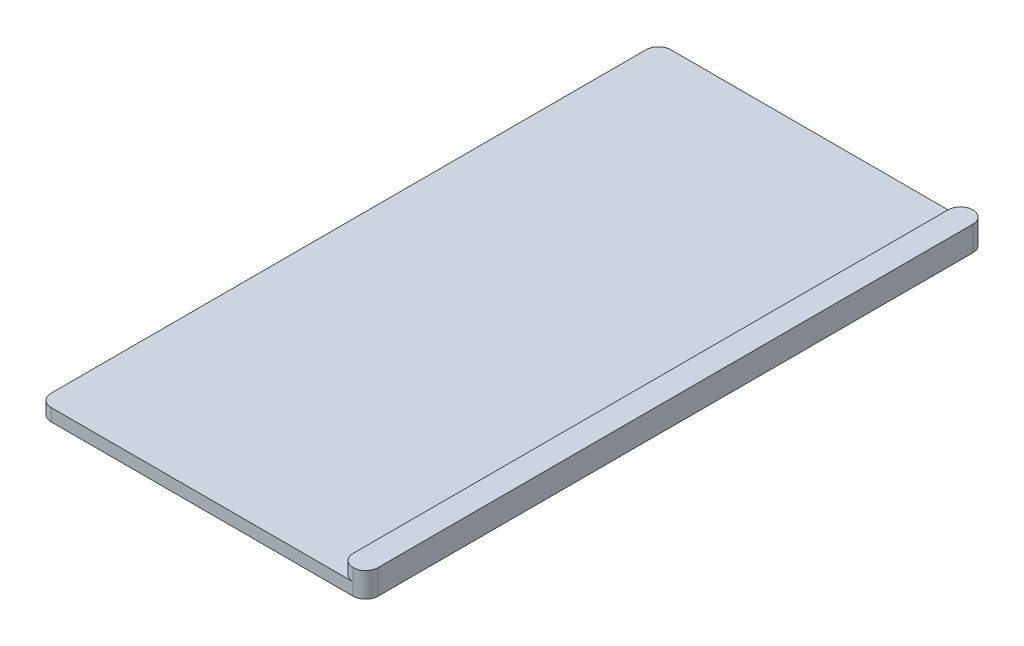
ISO-10303-21;
HEADER;
FILE_DESCRIPTION(('STEP AP214'),'2;1');
FILE_NAME('part.step','',(''),(''),'','','');
FILE_SCHEMA(('AUTOMOTIVE_DESIGN { 1 0 10303 214 1 1 1 1 }'));
ENDSEC;
DATA;
#1=APPLICATION_CONTEXT('core data for automotive mechanical design processes');
#2=APPLICATION_PROTOCOL_DEFINITION('international standard','automotive_design',2000,#1);
#3=PRODUCT_CONTEXT('',#1,'mechanical');
#4=PRODUCT('Part','Part','',(#3));
#5=PRODUCT_RELATED_PRODUCT_CATEGORY('part','',(#4));
#6=PRODUCT_DEFINITION_FORMATION('','',#4);
#7=PRODUCT_DEFINITION_CONTEXT('part definition',#1,'design');
#8=PRODUCT_DEFINITION('design','',#6,#7);
#9=PRODUCT_DEFINITION_SHAPE('','',#8);
#10=(LENGTH_UNIT() NAMED_UNIT(*) SI_UNIT(.MILLI.,.METRE.));
#11=(NAMED_UNIT(*) PLANE_ANGLE_UNIT() SI_UNIT($,.RADIAN.));
#12=(NAMED_UNIT(*) SI_UNIT($,.STERADIAN.) SOLID_ANGLE_UNIT());
#13=UNCERTAINTY_MEASURE_WITH_UNIT(LENGTH_MEASURE(1.E-05),#10,'distance_accuracy_value','');
#14=(GEOMETRIC_REPRESENTATION_CONTEXT(3) GLOBAL_UNCERTAINTY_ASSIGNED_CONTEXT((#13)) GLOBAL_UNIT_ASSIGNED_CONTEXT((#10,
#11,#12)) REPRESENTATION_CONTEXT('',''));
#15=CARTESIAN_POINT('',(0.,0.,0.));
#16=DIRECTION('',(0.,0.,1.));
#17=DIRECTION('',(1.,0.,0.));
#18=AXIS2_PLACEMENT_3D('',#15,#16,#17);
#19=CARTESIAN_POINT('',(0.,0.8,40.));
#20=DIRECTION('',(1.,0.,0.));
#21=DIRECTION('',(0.,0.,-1.));
#22=AXIS2_PLACEMENT_3D('',#19,#20,#21);
#23=PLANE('',#22);
#24=DIRECTION('',(0.,0.,-1.));
#25=VECTOR('',#24,1.);
#26=CARTESIAN_POINT('',(0.,0.8,40.));
#27=LINE('',#26,#25);
#28=CARTESIAN_POINT('',(0.,0.8,39.2));
#29=VERTEX_POINT('',#28);
#30=CARTESIAN_POINT('',(0.,0.8,0.800000000000002));
#31=VERTEX_POINT('',#30);
#32=EDGE_CURVE('E147',#29,#31,#27,.T.);
#33=ORIENTED_EDGE('',*,*,#32,.T.);
#34=DIRECTION('',(0.,-1.,0.));
#35=VECTOR('',#34,1.);
#36=CARTESIAN_POINT('',(0.,0.8,0.800000000000002));
#37=LINE('',#36,#35);
#38=CARTESIAN_POINT('',(0.,0.,0.800000000000002));
#39=VERTEX_POINT('',#38);
#40=EDGE_CURVE('E182',#31,#39,#37,.T.);
#41=ORIENTED_EDGE('',*,*,#40,.T.);
#42=DIRECTION('',(0.,0.,-1.));
#43=VECTOR('',#42,1.);
#44=CARTESIAN_POINT('',(0.,0.,40.));
#45=LINE('',#44,#43);
#46=CARTESIAN_POINT('',(0.,0.,39.2));
#47=VERTEX_POINT('',#46);
#48=EDGE_CURVE('E152',#47,#39,#45,.T.);
#49=ORIENTED_EDGE('',*,*,#48,.F.);
#50=DIRECTION('',(0.,-1.,0.));
#51=VECTOR('',#50,1.);
#52=CARTESIAN_POINT('',(0.,0.8,39.2));
#53=LINE('',#52,#51);
#54=EDGE_CURVE('E179',#47,#29,#53,.F.);
#55=ORIENTED_EDGE('',*,*,#54,.T.);
#56=EDGE_LOOP('',(#33,#41,#49,#55));
#57=FACE_BOUND('',#56,.T.);
#58=ADVANCED_FACE('F45',(#57),#23,.F.);
#59=CARTESIAN_POINT('',(0.,0.,40.));
#60=DIRECTION('',(0.,1.,0.));
#61=DIRECTION('',(0.,0.,1.));
#62=AXIS2_PLACEMENT_3D('',#59,#60,#61);
#63=PLANE('',#62);
#64=ORIENTED_EDGE('',*,*,#48,.T.);
#65=CARTESIAN_POINT('',(0.8,0.,0.800000000000002));
#66=DIRECTION('',(0.,1.,0.));
#67=DIRECTION('',(0.,0.,1.));
#68=AXIS2_PLACEMENT_3D('',#65,#66,#67);
#69=CIRCLE('',#68,0.8);
#70=CARTESIAN_POINT('',(0.8,0.,0.));
#71=VERTEX_POINT('',#70);
#72=EDGE_CURVE('E195',#39,#71,#69,.F.);
#73=ORIENTED_EDGE('',*,*,#72,.T.);
#74=DIRECTION('',(1.,0.,0.));
#75=VECTOR('',#74,1.);
#76=CARTESIAN_POINT('',(0.,0.,0.));
#77=LINE('',#76,#75);
#78=CARTESIAN_POINT('',(20.3,0.,0.));
#79=VERTEX_POINT('',#78);
#80=EDGE_CURVE('E220',#71,#79,#77,.T.);
#81=ORIENTED_EDGE('',*,*,#80,.T.);
#82=CARTESIAN_POINT('',(20.3,0.,0.800000000000002));
#83=DIRECTION('',(0.,1.,0.));
#84=DIRECTION('',(0.,0.,1.));
#85=AXIS2_PLACEMENT_3D('',#82,#83,#84);
#86=CIRCLE('',#85,0.8);
#87=CARTESIAN_POINT('',(21.1,0.,0.800000000000002));
#88=VERTEX_POINT('',#87);
#89=EDGE_CURVE('E192',#79,#88,#86,.F.);
#90=ORIENTED_EDGE('',*,*,#89,.T.);
#91=DIRECTION('',(0.,0.,-1.));
#92=VECTOR('',#91,1.);
#93=CARTESIAN_POINT('',(21.1,0.,40.));
#94=LINE('',#93,#92);
#95=CARTESIAN_POINT('',(21.1,0.,39.2));
#96=VERTEX_POINT('',#95);
#97=EDGE_CURVE('E159',#96,#88,#94,.T.);
#98=ORIENTED_EDGE('',*,*,#97,.F.);
#99=CARTESIAN_POINT('',(20.3,0.,39.2));
#100=DIRECTION('',(0.,1.,0.));
#101=DIRECTION('',(0.,0.,1.));
#102=AXIS2_PLACEMENT_3D('',#99,#100,#101);
#103=CIRCLE('',#102,0.8);
#104=CARTESIAN_POINT('',(20.3,0.,40.));
#105=VERTEX_POINT('',#104);
#106=EDGE_CURVE('E189',#96,#105,#103,.F.);
#107=ORIENTED_EDGE('',*,*,#106,.T.);
#108=DIRECTION('',(1.,0.,0.));
#109=VECTOR('',#108,1.);
#110=CARTESIAN_POINT('',(0.,0.,40.));
#111=LINE('',#110,#109);
#112=CARTESIAN_POINT('',(0.8,0.,40.));
#113=VERTEX_POINT('',#112);
#114=EDGE_CURVE('E257',#113,#105,#111,.T.);
#115=ORIENTED_EDGE('',*,*,#114,.F.);
#116=CARTESIAN_POINT('',(0.8,0.,39.2));
#117=DIRECTION('',(0.,1.,0.));
#118=DIRECTION('',(0.,0.,1.));
#119=AXIS2_PLACEMENT_3D('',#116,#117,#118);
#120=CIRCLE('',#119,0.8);
#121=EDGE_CURVE('E186',#113,#47,#120,.F.);
#122=ORIENTED_EDGE('',*,*,#121,.T.);
#123=EDGE_LOOP('',(#64,#73,#81,#90,#98,#107,#115,#122));
#124=FACE_BOUND('',#123,.T.);
#125=ADVANCED_FACE('F268',(#124),#63,.F.);
#126=CARTESIAN_POINT('',(21.1,0.,40.));
#127=DIRECTION('',(-1.,0.,0.));
#128=DIRECTION('',(0.,0.,1.));
#129=AXIS2_PLACEMENT_3D('',#126,#127,#128);
#130=PLANE('',#129);
#131=ORIENTED_EDGE('',*,*,#97,.T.);
#132=DIRECTION('',(0.,1.,0.));
#133=VECTOR('',#132,1.);
#134=CARTESIAN_POINT('',(21.1,0.,0.800000000000002));
#135=LINE('',#134,#133);
#136=CARTESIAN_POINT('',(21.1,1.6,0.800000000000002));
#137=VERTEX_POINT('',#136);
#138=EDGE_CURVE('E206',#88,#137,#135,.T.);
#139=ORIENTED_EDGE('',*,*,#138,.T.);
#140=DIRECTION('',(0.,0.,-1.));
#141=VECTOR('',#140,1.);
#142=CARTESIAN_POINT('',(21.1,1.6,40.));
#143=LINE('',#142,#141);
#144=CARTESIAN_POINT('',(21.1,1.6,39.2));
#145=VERTEX_POINT('',#144);
#146=EDGE_CURVE('E240',#145,#137,#143,.T.);
#147=ORIENTED_EDGE('',*,*,#146,.F.);
#148=DIRECTION('',(0.,1.,0.));
#149=VECTOR('',#148,1.);
#150=CARTESIAN_POINT('',(21.1,0.,39.2));
#151=LINE('',#150,#149);
#152=EDGE_CURVE('E203',#145,#96,#151,.F.);
#153=ORIENTED_EDGE('',*,*,#152,.T.);
#154=EDGE_LOOP('',(#131,#139,#147,#153));
#155=FACE_BOUND('',#154,.T.);
#156=ADVANCED_FACE('F244',(#155),#130,.F.);
#157=CARTESIAN_POINT('',(21.1,1.6,40.));
#158=DIRECTION('',(0.,-1.,0.));
#159=DIRECTION('',(1.,0.,0.));
#160=AXIS2_PLACEMENT_3D('',#157,#158,#159);
#161=PLANE('',#160);
#162=CARTESIAN_POINT('',(20.3,1.6,0.800000000000002));
#163=DIRECTION('',(0.,-1.,0.));
#164=DIRECTION('',(1.,0.,0.));
#165=AXIS2_PLACEMENT_3D('',#162,#163,#164);
#166=CIRCLE('',#165,0.8);
#167=CARTESIAN_POINT('',(20.3,1.6,0.));
#168=VERTEX_POINT('',#167);
#169=EDGE_CURVE('E173',#137,#168,#166,.F.);
#170=ORIENTED_EDGE('',*,*,#169,.T.);
#171=CARTESIAN_POINT('',(20.3,1.6,0.800000000000002));
#172=DIRECTION('',(0.,-1.,0.));
#173=DIRECTION('',(1.,0.,0.));
#174=AXIS2_PLACEMENT_3D('',#171,#172,#173);
#175=CIRCLE('',#174,0.8);
#176=CARTESIAN_POINT('',(19.5,1.6,0.800000000000002));
#177=VERTEX_POINT('',#176);
#178=EDGE_CURVE('E176',#168,#177,#175,.F.);
#179=ORIENTED_EDGE('',*,*,#178,.T.);
#180=DIRECTION('',(0.,0.,-1.));
#181=VECTOR('',#180,1.);
#182=CARTESIAN_POINT('',(19.5,1.6,40.));
#183=LINE('',#182,#181);
#184=CARTESIAN_POINT('',(19.5,1.6,39.2));
#185=VERTEX_POINT('',#184);
#186=EDGE_CURVE('E146',#185,#177,#183,.T.);
#187=ORIENTED_EDGE('',*,*,#186,.F.);
#188=CARTESIAN_POINT('',(20.3,1.6,39.2));
#189=DIRECTION('',(0.,-1.,0.));
#190=DIRECTION('',(1.,0.,0.));
#191=AXIS2_PLACEMENT_3D('',#188,#189,#190);
#192=CIRCLE('',#191,0.8);
#193=CARTESIAN_POINT('',(20.3,1.6,40.));
#194=VERTEX_POINT('',#193);
#195=EDGE_CURVE('E150',#185,#194,#192,.F.);
#196=ORIENTED_EDGE('',*,*,#195,.T.);
#197=CARTESIAN_POINT('',(20.3,1.6,39.2));
#198=DIRECTION('',(0.,-1.,0.));
#199=DIRECTION('',(1.,0.,0.));
#200=AXIS2_PLACEMENT_3D('',#197,#198,#199);
#201=CIRCLE('',#200,0.8);
#202=EDGE_CURVE('E168',#194,#145,#201,.F.);
#203=ORIENTED_EDGE('',*,*,#202,.T.);
#204=ORIENTED_EDGE('',*,*,#146,.T.);
#205=EDGE_LOOP('',(#170,#179,#187,#196,#203,#204));
#206=FACE_BOUND('',#205,.T.);
#207=ADVANCED_FACE('F239',(#206),#161,.F.);
#208=CARTESIAN_POINT('',(19.5,1.6,40.));
#209=DIRECTION('',(1.,0.,0.));
#210=DIRECTION('',(0.,0.,-1.));
#211=AXIS2_PLACEMENT_3D('',#208,#209,#210);
#212=PLANE('',#211);
#213=ORIENTED_EDGE('',*,*,#186,.T.);
#214=DIRECTION('',(0.,-1.,0.));
#215=VECTOR('',#214,1.);
#216=CARTESIAN_POINT('',(19.5,1.6,0.800000000000002));
#217=LINE('',#216,#215);
#218=CARTESIAN_POINT('',(19.5,0.800000000000002,0.800000000000002));
#219=VERTEX_POINT('',#218);
#220=EDGE_CURVE('E144',#177,#219,#217,.T.);
#221=ORIENTED_EDGE('',*,*,#220,.T.);
#222=DIRECTION('',(0.,0.,-1.));
#223=VECTOR('',#222,1.);
#224=CARTESIAN_POINT('',(19.5,0.800000000000002,40.));
#225=LINE('',#224,#223);
#226=CARTESIAN_POINT('',(19.5,0.800000000000002,39.2));
#227=VERTEX_POINT('',#226);
#228=EDGE_CURVE('E132',#227,#219,#225,.T.);
#229=ORIENTED_EDGE('',*,*,#228,.F.);
#230=DIRECTION('',(0.,-1.,0.));
#231=VECTOR('',#230,1.);
#232=CARTESIAN_POINT('',(19.5,1.6,39.2));
#233=LINE('',#232,#231);
#234=EDGE_CURVE('E141',#227,#185,#233,.F.);
#235=ORIENTED_EDGE('',*,*,#234,.T.);
#236=EDGE_LOOP('',(#213,#221,#229,#235));
#237=FACE_BOUND('',#236,.T.);
#238=ADVANCED_FACE('F140',(#237),#212,.F.);
#239=CARTESIAN_POINT('',(19.5,0.800000000000002,40.));
#240=DIRECTION('',(0.,-1.,0.));
#241=DIRECTION('',(1.,0.,0.));
#242=AXIS2_PLACEMENT_3D('',#239,#240,#241);
#243=PLANE('',#242);
#244=DIRECTION('',(-1.,0.,0.));
#245=VECTOR('',#244,1.);
#246=CARTESIAN_POINT('',(19.5,0.800000000000002,0.));
#247=LINE('',#246,#245);
#248=CARTESIAN_POINT('',(20.3,0.800000000000002,0.));
#249=VERTEX_POINT('',#248);
#250=CARTESIAN_POINT('',(0.799999999999999,0.8,0.));
#251=VERTEX_POINT('',#250);
#252=EDGE_CURVE('E227',#249,#251,#247,.T.);
#253=ORIENTED_EDGE('',*,*,#252,.T.);
#254=CARTESIAN_POINT('',(0.8,0.8,0.800000000000002));
#255=DIRECTION('',(0.,-1.,0.));
#256=DIRECTION('',(1.,0.,0.));
#257=AXIS2_PLACEMENT_3D('',#254,#255,#256);
#258=CIRCLE('',#257,0.8);
#259=EDGE_CURVE('E200',#251,#31,#258,.F.);
#260=ORIENTED_EDGE('',*,*,#259,.T.);
#261=ORIENTED_EDGE('',*,*,#32,.F.);
#262=CARTESIAN_POINT('',(0.8,0.8,39.2));
#263=DIRECTION('',(0.,-1.,0.));
#264=DIRECTION('',(1.,0.,0.));
#265=AXIS2_PLACEMENT_3D('',#262,#263,#264);
#266=CIRCLE('',#265,0.8);
#267=CARTESIAN_POINT('',(0.799999999999999,0.8,40.));
#268=VERTEX_POINT('',#267);
#269=EDGE_CURVE('E67',#29,#268,#266,.F.);
#270=ORIENTED_EDGE('',*,*,#269,.T.);
#271=DIRECTION('',(-1.,0.,0.));
#272=VECTOR('',#271,1.);
#273=CARTESIAN_POINT('',(19.5,0.800000000000002,40.));
#274=LINE('',#273,#272);
#275=CARTESIAN_POINT('',(20.3,0.800000000000002,40.));
#276=VERTEX_POINT('',#275);
#277=EDGE_CURVE('E62',#276,#268,#274,.T.);
#278=ORIENTED_EDGE('',*,*,#277,.F.);
#279=CARTESIAN_POINT('',(20.3,0.800000000000002,39.2));
#280=DIRECTION('',(0.,-1.,0.));
#281=DIRECTION('',(1.,0.,0.));
#282=AXIS2_PLACEMENT_3D('',#279,#280,#281);
#283=CIRCLE('',#282,0.8);
#284=EDGE_CURVE('E11',#276,#227,#283,.T.);
#285=ORIENTED_EDGE('',*,*,#284,.T.);
#286=ORIENTED_EDGE('',*,*,#228,.T.);
#287=CARTESIAN_POINT('',(20.3,0.800000000000002,0.800000000000002));
#288=DIRECTION('',(0.,-1.,0.));
#289=DIRECTION('',(1.,0.,0.));
#290=AXIS2_PLACEMENT_3D('',#287,#288,#289);
#291=CIRCLE('',#290,0.8);
#292=EDGE_CURVE('E55',#219,#249,#291,.T.);
#293=ORIENTED_EDGE('',*,*,#292,.T.);
#294=EDGE_LOOP('',(#253,#260,#261,#270,#278,#285,#286,#293));
#295=FACE_BOUND('',#294,.T.);
#296=ADVANCED_FACE('F130',(#295),#243,.F.);
#297=CARTESIAN_POINT('',(0.,0.,40.));
#298=DIRECTION('',(0.,0.,1.));
#299=DIRECTION('',(1.,0.,0.));
#300=AXIS2_PLACEMENT_3D('',#297,#298,#299);
#301=PLANE('',#300);
#302=DIRECTION('',(0.,1.,0.));
#303=VECTOR('',#302,1.);
#304=CARTESIAN_POINT('',(20.3,1.6,40.));
#305=LINE('',#304,#303);
#306=EDGE_CURVE('E213',#105,#276,#305,.T.);
#307=ORIENTED_EDGE('',*,*,#306,.T.);
#308=ORIENTED_EDGE('',*,*,#277,.T.);
#309=DIRECTION('',(0.,-1.,0.));
#310=VECTOR('',#309,1.);
#311=CARTESIAN_POINT('',(0.8,0.,40.));
#312=LINE('',#311,#310);
#313=EDGE_CURVE('E209',#268,#113,#312,.T.);
#314=ORIENTED_EDGE('',*,*,#313,.T.);
#315=ORIENTED_EDGE('',*,*,#114,.T.);
#316=EDGE_LOOP('',(#307,#308,#314,#315));
#317=FACE_BOUND('',#316,.T.);
#318=ADVANCED_FACE('F265',(#317),#301,.T.);
#319=CARTESIAN_POINT('',(0.,0.,0.));
#320=DIRECTION('',(0.,0.,1.));
#321=DIRECTION('',(1.,0.,0.));
#322=AXIS2_PLACEMENT_3D('',#319,#320,#321);
#323=PLANE('',#322);
#324=ORIENTED_EDGE('',*,*,#80,.F.);
#325=DIRECTION('',(0.,-1.,0.));
#326=VECTOR('',#325,1.);
#327=CARTESIAN_POINT('',(0.8,0.,0.));
#328=LINE('',#327,#326);
#329=EDGE_CURVE('E165',#71,#251,#328,.F.);
#330=ORIENTED_EDGE('',*,*,#329,.T.);
#331=ORIENTED_EDGE('',*,*,#252,.F.);
#332=DIRECTION('',(0.,1.,0.));
#333=VECTOR('',#332,1.);
#334=CARTESIAN_POINT('',(20.3,0.,0.));
#335=LINE('',#334,#333);
#336=EDGE_CURVE('E156',#249,#79,#335,.F.);
#337=ORIENTED_EDGE('',*,*,#336,.T.);
#338=EDGE_LOOP('',(#324,#330,#331,#337));
#339=FACE_BOUND('',#338,.T.);
#340=ADVANCED_FACE('F278',(#339),#323,.F.);
#341=CARTESIAN_POINT('',(20.3,0.,0.800000000000002));
#342=DIRECTION('',(0.,1.,0.));
#343=DIRECTION('',(0.,0.,1.));
#344=AXIS2_PLACEMENT_3D('',#341,#342,#343);
#345=CYLINDRICAL_SURFACE('',#344,0.8);
#346=DIRECTION('',(0.,1.,0.));
#347=VECTOR('',#346,1.);
#348=CARTESIAN_POINT('',(20.3,0.,0.));
#349=LINE('',#348,#347);
#350=EDGE_CURVE('E217',#168,#249,#349,.F.);
#351=ORIENTED_EDGE('',*,*,#350,.F.);
#352=ORIENTED_EDGE('',*,*,#169,.F.);
#353=ORIENTED_EDGE('',*,*,#138,.F.);
#354=ORIENTED_EDGE('',*,*,#89,.F.);
#355=ORIENTED_EDGE('',*,*,#336,.F.);
#356=EDGE_LOOP('',(#351,#352,#353,#354,#355));
#357=FACE_BOUND('',#356,.T.);
#358=ADVANCED_FACE('F272',(#357),#345,.T.);
#359=CARTESIAN_POINT('',(20.3,1.6,0.800000000000002));
#360=DIRECTION('',(0.,-1.,0.));
#361=DIRECTION('',(0.,0.,-1.));
#362=AXIS2_PLACEMENT_3D('',#359,#360,#361);
#363=CYLINDRICAL_SURFACE('',#362,0.8);
#364=ORIENTED_EDGE('',*,*,#178,.F.);
#365=ORIENTED_EDGE('',*,*,#350,.T.);
#366=ORIENTED_EDGE('',*,*,#292,.F.);
#367=ORIENTED_EDGE('',*,*,#220,.F.);
#368=EDGE_LOOP('',(#364,#365,#366,#367));
#369=FACE_BOUND('',#368,.T.);
#370=ADVANCED_FACE('F274',(#369),#363,.T.);
#371=CARTESIAN_POINT('',(0.8,0.8,0.800000000000002));
#372=DIRECTION('',(0.,-1.,0.));
#373=DIRECTION('',(0.,0.,-1.));
#374=AXIS2_PLACEMENT_3D('',#371,#372,#373);
#375=CYLINDRICAL_SURFACE('',#374,0.8);
#376=ORIENTED_EDGE('',*,*,#259,.F.);
#377=ORIENTED_EDGE('',*,*,#329,.F.);
#378=ORIENTED_EDGE('',*,*,#72,.F.);
#379=ORIENTED_EDGE('',*,*,#40,.F.);
#380=EDGE_LOOP('',(#376,#377,#378,#379));
#381=FACE_BOUND('',#380,.T.);
#382=ADVANCED_FACE('F282',(#381),#375,.T.);
#383=CARTESIAN_POINT('',(20.3,0.,39.2));
#384=DIRECTION('',(0.,-1.,0.));
#385=DIRECTION('',(0.,0.,-1.));
#386=AXIS2_PLACEMENT_3D('',#383,#384,#385);
#387=CYLINDRICAL_SURFACE('',#386,0.8);
#388=ORIENTED_EDGE('',*,*,#152,.F.);
#389=ORIENTED_EDGE('',*,*,#202,.F.);
#390=DIRECTION('',(0.,1.,0.));
#391=VECTOR('',#390,1.);
#392=CARTESIAN_POINT('',(20.3,1.6,40.));
#393=LINE('',#392,#391);
#394=EDGE_CURVE('E49',#276,#194,#393,.T.);
#395=ORIENTED_EDGE('',*,*,#394,.F.);
#396=ORIENTED_EDGE('',*,*,#306,.F.);
#397=ORIENTED_EDGE('',*,*,#106,.F.);
#398=EDGE_LOOP('',(#388,#389,#395,#396,#397));
#399=FACE_BOUND('',#398,.T.);
#400=ADVANCED_FACE('F234',(#399),#387,.T.);
#401=CARTESIAN_POINT('',(20.3,0.,39.2));
#402=DIRECTION('',(0.,1.,0.));
#403=DIRECTION('',(0.,0.,1.));
#404=AXIS2_PLACEMENT_3D('',#401,#402,#403);
#405=CYLINDRICAL_SURFACE('',#404,0.8);
#406=ORIENTED_EDGE('',*,*,#195,.F.);
#407=ORIENTED_EDGE('',*,*,#234,.F.);
#408=ORIENTED_EDGE('',*,*,#284,.F.);
#409=ORIENTED_EDGE('',*,*,#394,.T.);
#410=EDGE_LOOP('',(#406,#407,#408,#409));
#411=FACE_BOUND('',#410,.T.);
#412=ADVANCED_FACE('F149',(#411),#405,.T.);
#413=CARTESIAN_POINT('',(0.8,0.,39.2));
#414=DIRECTION('',(0.,1.,0.));
#415=DIRECTION('',(0.,0.,1.));
#416=AXIS2_PLACEMENT_3D('',#413,#414,#415);
#417=CYLINDRICAL_SURFACE('',#416,0.8);
#418=ORIENTED_EDGE('',*,*,#269,.F.);
#419=ORIENTED_EDGE('',*,*,#54,.F.);
#420=ORIENTED_EDGE('',*,*,#121,.F.);
#421=ORIENTED_EDGE('',*,*,#313,.F.);
#422=EDGE_LOOP('',(#418,#419,#420,#421));
#423=FACE_BOUND('',#422,.T.);
#424=ADVANCED_FACE('F47',(#423),#417,.T.);
#425=CLOSED_SHELL('',(#58,#125,#156,#207,#238,#296,#318,#340,#358,#370,#382,#400,#412,#424));
#426=MANIFOLD_SOLID_BREP('B2',#425);
#427=ADVANCED_BREP_SHAPE_REPRESENTATION('',(#18,#426),#14);
#428=SHAPE_DEFINITION_REPRESENTATION(#9,#427);
ENDSEC;
END-ISO-10303-21;
